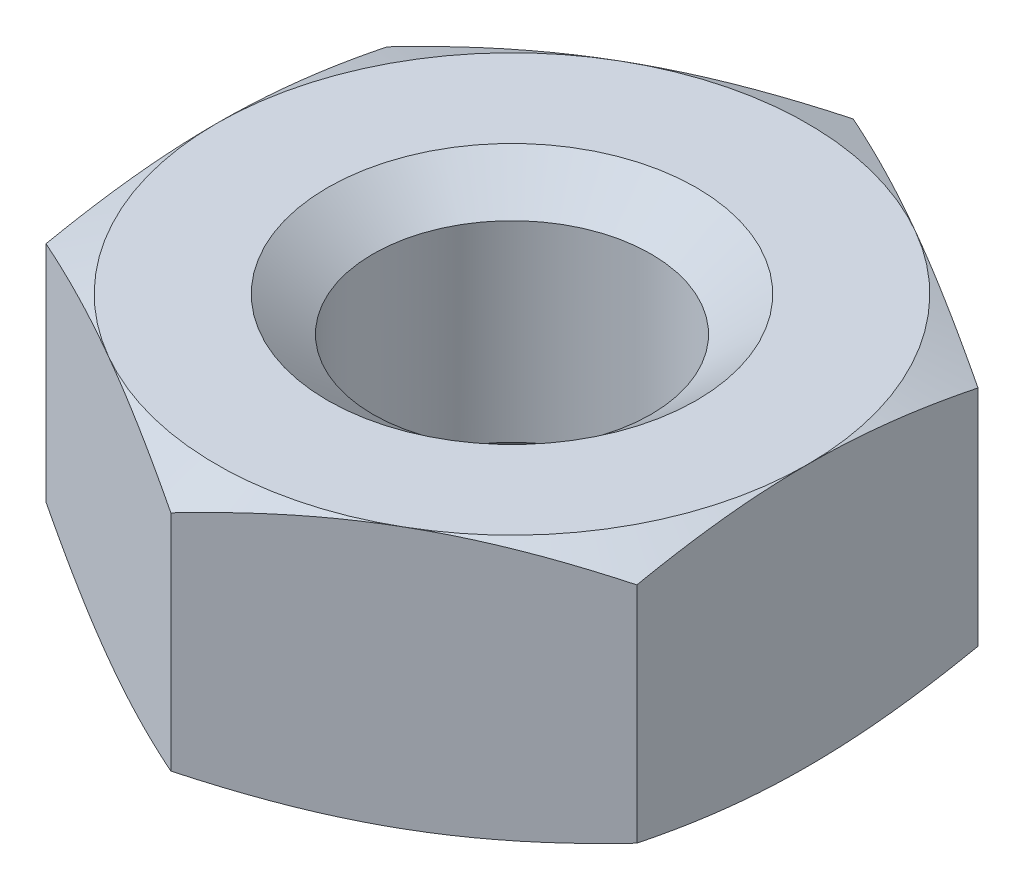
ISO-10303-21;
HEADER;
FILE_DESCRIPTION(('STEP AP214'),'2;1');
FILE_NAME('part.step','',(''),(''),'','','');
FILE_SCHEMA(('AUTOMOTIVE_DESIGN { 1 0 10303 214 1 1 1 1 }'));
ENDSEC;
DATA;
#1=APPLICATION_CONTEXT('core data for automotive mechanical design processes');
#2=APPLICATION_PROTOCOL_DEFINITION('international standard','automotive_design',2000,#1);
#3=PRODUCT_CONTEXT('',#1,'mechanical');
#4=PRODUCT('Part','Part','',(#3));
#5=PRODUCT_RELATED_PRODUCT_CATEGORY('part','',(#4));
#6=PRODUCT_DEFINITION_FORMATION('','',#4);
#7=PRODUCT_DEFINITION_CONTEXT('part definition',#1,'design');
#8=PRODUCT_DEFINITION('design','',#6,#7);
#9=PRODUCT_DEFINITION_SHAPE('','',#8);
#10=(LENGTH_UNIT() NAMED_UNIT(*) SI_UNIT(.MILLI.,.METRE.));
#11=(NAMED_UNIT(*) PLANE_ANGLE_UNIT() SI_UNIT($,.RADIAN.));
#12=(NAMED_UNIT(*) SI_UNIT($,.STERADIAN.) SOLID_ANGLE_UNIT());
#13=UNCERTAINTY_MEASURE_WITH_UNIT(LENGTH_MEASURE(1.E-05),#10,'distance_accuracy_value','');
#14=(GEOMETRIC_REPRESENTATION_CONTEXT(3) GLOBAL_UNCERTAINTY_ASSIGNED_CONTEXT((#13)) GLOBAL_UNIT_ASSIGNED_CONTEXT((#10,
#11,#12)) REPRESENTATION_CONTEXT('',''));
#15=CARTESIAN_POINT('',(0.,0.,0.));
#16=DIRECTION('',(0.,0.,1.));
#17=DIRECTION('',(1.,0.,0.));
#18=AXIS2_PLACEMENT_3D('',#15,#16,#17);
#19=CARTESIAN_POINT('',(0.,-1.52500000000001,0.));
#20=DIRECTION('',(0.,1.,0.));
#21=DIRECTION('',(0.,0.,1.));
#22=AXIS2_PLACEMENT_3D('',#19,#20,#21);
#23=CONICAL_SURFACE('',#22,3.44499999999997,1.17809724509618);
#24=CARTESIAN_POINT('',(3.44499999999999,-1.52500000000001,0.));
#25=CARTESIAN_POINT('',(3.44499999999999,-1.52500653519659,-0.0836770238553707));
#26=CARTESIAN_POINT('',(3.44499999999999,-1.523736539951,-0.167348336923047));
#27=CARTESIAN_POINT('',(3.44499999999999,-1.51869977778039,-0.334608821328024));
#28=CARTESIAN_POINT('',(3.44499999999999,-1.51493322636125,-0.418197999131677));
#29=CARTESIAN_POINT('',(3.44499999999999,-1.50000011813595,-0.668300761406539));
#30=CARTESIAN_POINT('',(3.44499999999999,-1.48519949166168,-0.834608265477263));
#31=CARTESIAN_POINT('',(3.44499999999999,-1.44691557663054,-1.16608574327092));
#32=CARTESIAN_POINT('',(3.44499999999999,-1.42343721863474,-1.33125630880567));
#33=CARTESIAN_POINT('',(3.44499999999999,-1.36907122689802,-1.66083827114248));
#34=CARTESIAN_POINT('',(3.44499999999999,-1.33816390417375,-1.82524644688072));
#35=CARTESIAN_POINT('',(3.44499999999999,-1.30424763449981,-1.98897167735825));
#36=B_SPLINE_CURVE_WITH_KNOTS('',3,(#24,#25,#26,#27,#28,#29,#30,#31,#32,#33,#34,#35),
.UNSPECIFIED.,.F.,.F.,(4,2,2,2,2,4),(0.,0.251010681069905,0.501999697400777,1.00260384828627,
1.50292399932506,2.00458506025341),.UNSPECIFIED.);
#37=CARTESIAN_POINT('',(3.44499999999999,-1.525,0.));
#38=VERTEX_POINT('',#37);
#39=CARTESIAN_POINT('',(3.44499999999999,-1.30424763449981,-1.98897167735825));
#40=VERTEX_POINT('',#39);
#41=EDGE_CURVE('E250',#38,#40,#36,.T.);
#42=ORIENTED_EDGE('',*,*,#41,.F.);
#43=CARTESIAN_POINT('',(0.,-1.525,0.));
#44=DIRECTION('',(0.,1.,0.));
#45=DIRECTION('',(0.,0.,1.));
#46=AXIS2_PLACEMENT_3D('',#43,#44,#45);
#47=CIRCLE('',#46,3.44499999999998);
#48=CARTESIAN_POINT('',(1.7225,-1.525,-2.98345751603738));
#49=VERTEX_POINT('',#48);
#50=EDGE_CURVE('E112',#49,#38,#47,.F.);
#51=ORIENTED_EDGE('',*,*,#50,.F.);
#52=CARTESIAN_POINT('',(3.44499999999998,-1.30424763449981,-1.98897167735824));
#53=CARTESIAN_POINT('',(3.30320979116598,-1.33816390417375,-2.07083429259701));
#54=CARTESIAN_POINT('',(3.16082813438681,-1.36907122689802,-2.15303838046613));
#55=CARTESIAN_POINT('',(2.875401782374,-1.42343721863474,-2.31782936163454));
#56=CARTESIAN_POINT('',(2.73235987666347,-1.44691557663055,-2.40041464440191));
#57=CARTESIAN_POINT('',(2.44529196011177,-1.48519949166168,-2.56615338329874));
#58=CARTESIAN_POINT('',(2.30126543674653,-1.50000011813595,-2.6493071353341));
#59=CARTESIAN_POINT('',(2.08467009105984,-1.51493322636125,-2.77435851647153));
#60=CARTESIAN_POINT('',(2.01227973960043,-1.51869977778039,-2.81615310537336));
#61=CARTESIAN_POINT('',(1.86742791105642,-1.52373653995101,-2.89978334757585));
#62=CARTESIAN_POINT('',(1.79496642837181,-1.52500653519659,-2.94161900410969));
#63=CARTESIAN_POINT('',(1.72249999999999,-1.52500000000001,-2.98345751603737));
#64=B_SPLINE_CURVE_WITH_KNOTS('',3,(#52,#53,#54,#55,#56,#57,#58,#59,#60,#61,#62,#63),
.UNSPECIFIED.,.F.,.F.,(4,2,2,2,2,4),(0.,0.501661060928354,1.00198121196715,1.50258536285264,
1.75357437918352,2.00458506025342),.UNSPECIFIED.);
#65=EDGE_CURVE('E249',#40,#49,#64,.T.);
#66=ORIENTED_EDGE('',*,*,#65,.F.);
#67=EDGE_LOOP('',(#42,#51,#66));
#68=FACE_BOUND('',#67,.T.);
#69=ADVANCED_FACE('F15',(#68),#23,.T.);
#70=CARTESIAN_POINT('',(0.,-1.11908402335913,0.));
#71=DIRECTION('',(0.,-1.,0.));
#72=DIRECTION('',(0.,0.,-1.));
#73=AXIS2_PLACEMENT_3D('',#70,#71,#72);
#74=CONICAL_SURFACE('',#73,1.621,0.916297857297024);
#75=CARTESIAN_POINT('',(0.,-1.11908402335913,0.));
#76=DIRECTION('',(0.,-1.,0.));
#77=DIRECTION('',(0.,0.,-1.));
#78=AXIS2_PLACEMENT_3D('',#75,#76,#77);
#79=CIRCLE('',#78,1.621);
#80=CARTESIAN_POINT('',(0.,-1.11908402335913,-1.621));
#81=VERTEX_POINT('',#80);
#82=EDGE_CURVE('E244',#81,#81,#79,.T.);
#83=ORIENTED_EDGE('',*,*,#82,.F.);
#84=EDGE_LOOP('',(#83));
#85=FACE_BOUND('',#84,.T.);
#86=CARTESIAN_POINT('',(0.,-1.525,0.));
#87=DIRECTION('',(0.,-1.,0.));
#88=DIRECTION('',(0.,0.,-1.));
#89=AXIS2_PLACEMENT_3D('',#86,#87,#88);
#90=CIRCLE('',#89,2.15);
#91=CARTESIAN_POINT('',(0.,-1.525,-2.15));
#92=VERTEX_POINT('',#91);
#93=EDGE_CURVE('E355',#92,#92,#90,.F.);
#94=ORIENTED_EDGE('',*,*,#93,.F.);
#95=EDGE_LOOP('',(#94));
#96=FACE_BOUND('',#95,.T.);
#97=ADVANCED_FACE('F525',(#85,#96),#74,.F.);
#98=CARTESIAN_POINT('',(0.,-1.52500000000001,0.));
#99=DIRECTION('',(0.,1.,0.));
#100=DIRECTION('',(0.,0.,1.));
#101=AXIS2_PLACEMENT_3D('',#98,#99,#100);
#102=CONICAL_SURFACE('',#101,3.44499999999995,1.17809724509617);
#103=CARTESIAN_POINT('',(0.,-1.525,0.));
#104=DIRECTION('',(0.,1.,0.));
#105=DIRECTION('',(0.,0.,1.));
#106=AXIS2_PLACEMENT_3D('',#103,#104,#105);
#107=CIRCLE('',#106,3.44499999999998);
#108=CARTESIAN_POINT('',(-1.72249999999999,-1.525,-2.9834575160374));
#109=VERTEX_POINT('',#108);
#110=EDGE_CURVE('E20',#109,#49,#107,.F.);
#111=ORIENTED_EDGE('',*,*,#110,.F.);
#112=CARTESIAN_POINT('',(0.,-1.3042476344998,-3.97794335471651));
#113=CARTESIAN_POINT('',(-0.141790208834029,-1.33816390417374,-3.89608073947775));
#114=CARTESIAN_POINT('',(-0.284171865613201,-1.36907122689801,-3.81387665160863));
#115=CARTESIAN_POINT('',(-0.569598217625999,-1.42343721863473,-3.64908567044023));
#116=CARTESIAN_POINT('',(-0.712640123336535,-1.44691557663054,-3.56650038767285));
#117=CARTESIAN_POINT('',(-0.99970803988823,-1.48519949166167,-3.40076164877602));
#118=CARTESIAN_POINT('',(-1.14373456325346,-1.50000011813594,-3.31760789674066));
#119=CARTESIAN_POINT('',(-1.36032990894015,-1.51493322636124,-3.19255651560323));
#120=CARTESIAN_POINT('',(-1.43272026039957,-1.51869977778038,-3.15076192670141));
#121=CARTESIAN_POINT('',(-1.57757208894356,-1.523736539951,-3.06713168449892));
#122=CARTESIAN_POINT('',(-1.65003357162817,-1.52500653519658,-3.02529602796508));
#123=CARTESIAN_POINT('',(-1.7225,-1.525,-2.9834575160374));
#124=B_SPLINE_CURVE_WITH_KNOTS('',3,(#112,#113,#114,#115,#116,#117,#118,#119,#120,#121,#122,
#123),.UNSPECIFIED.,.F.,.F.,(4,2,2,2,2,4),(0.,0.501661060928347,1.00198121196714,
1.50258536285262,1.75357437918349,2.0045850602534),.UNSPECIFIED.);
#125=CARTESIAN_POINT('',(0.,-1.3042476344998,-3.97794335471651));
#126=VERTEX_POINT('',#125);
#127=EDGE_CURVE('E107',#126,#109,#124,.T.);
#128=ORIENTED_EDGE('',*,*,#127,.F.);
#129=CARTESIAN_POINT('',(1.72249999999999,-1.52500000000001,-2.98345751603737));
#130=CARTESIAN_POINT('',(1.65003357162816,-1.52500653519659,-3.02529602796506));
#131=CARTESIAN_POINT('',(1.57757208894355,-1.52373653995101,-3.0671316844989));
#132=CARTESIAN_POINT('',(1.43272026039955,-1.51869977778039,-3.15076192670139));
#133=CARTESIAN_POINT('',(1.36032990894013,-1.51493322636125,-3.19255651560321));
#134=CARTESIAN_POINT('',(1.14373456325343,-1.50000011813595,-3.31760789674065));
#135=CARTESIAN_POINT('',(0.999708039888201,-1.48519949166168,-3.40076164877601));
#136=CARTESIAN_POINT('',(0.712640123336499,-1.44691557663054,-3.56650038767284));
#137=CARTESIAN_POINT('',(0.569598217625959,-1.42343721863474,-3.64908567044022));
#138=CARTESIAN_POINT('',(0.284171865613155,-1.36907122689801,-3.81387665160862));
#139=CARTESIAN_POINT('',(0.14179020883398,-1.33816390417374,-3.89608073947775));
#140=CARTESIAN_POINT('',(0.,-1.3042476344998,-3.97794335471651));
#141=B_SPLINE_CURVE_WITH_KNOTS('',3,(#129,#130,#131,#132,#133,#134,#135,#136,#137,#138,#139,
#140),.UNSPECIFIED.,.F.,.F.,(4,2,2,2,2,4),(0.,0.251010681069908,0.501999697400784,
1.00260384828628,1.50292399932508,2.00458506025344),.UNSPECIFIED.);
#142=EDGE_CURVE('E109',#49,#126,#141,.T.);
#143=ORIENTED_EDGE('',*,*,#142,.F.);
#144=EDGE_LOOP('',(#111,#128,#143));
#145=FACE_BOUND('',#144,.T.);
#146=ADVANCED_FACE('F106',(#145),#102,.T.);
#147=CARTESIAN_POINT('',(-3.455,-1.525,3.98794335471652));
#148=DIRECTION('',(0.,-1.,0.));
#149=DIRECTION('',(0.,0.,-1.));
#150=AXIS2_PLACEMENT_3D('',#147,#148,#149);
#151=PLANE('',#150);
#152=ORIENTED_EDGE('',*,*,#93,.T.);
#153=EDGE_LOOP('',(#152));
#154=FACE_BOUND('',#153,.T.);
#155=CARTESIAN_POINT('',(0.,-1.52500000000001,0.));
#156=DIRECTION('',(0.,1.,0.));
#157=DIRECTION('',(0.,0.,1.));
#158=AXIS2_PLACEMENT_3D('',#155,#156,#157);
#159=CIRCLE('',#158,3.44499999999998);
#160=CARTESIAN_POINT('',(1.7225,-1.525,2.98345751603739));
#161=VERTEX_POINT('',#160);
#162=EDGE_CURVE('E346',#161,#38,#159,.T.);
#163=ORIENTED_EDGE('',*,*,#162,.F.);
#164=CARTESIAN_POINT('',(0.,-1.525,0.));
#165=DIRECTION('',(0.,1.,0.));
#166=DIRECTION('',(0.,0.,1.));
#167=AXIS2_PLACEMENT_3D('',#164,#165,#166);
#168=CIRCLE('',#167,3.44499999999999);
#169=CARTESIAN_POINT('',(-1.72249999999999,-1.525,2.98345751603741));
#170=VERTEX_POINT('',#169);
#171=EDGE_CURVE('E375',#170,#161,#168,.T.);
#172=ORIENTED_EDGE('',*,*,#171,.F.);
#173=CARTESIAN_POINT('',(0.,-1.525,0.));
#174=DIRECTION('',(0.,1.,0.));
#175=DIRECTION('',(0.,0.,1.));
#176=AXIS2_PLACEMENT_3D('',#173,#174,#175);
#177=CIRCLE('',#176,3.44500000000002);
#178=CARTESIAN_POINT('',(-3.44500000000001,-1.52499999999999,0.));
#179=VERTEX_POINT('',#178);
#180=EDGE_CURVE('E126',#179,#170,#177,.T.);
#181=ORIENTED_EDGE('',*,*,#180,.F.);
#182=CARTESIAN_POINT('',(0.,-1.525,0.));
#183=DIRECTION('',(0.,1.,0.));
#184=DIRECTION('',(0.,0.,1.));
#185=AXIS2_PLACEMENT_3D('',#182,#183,#184);
#186=CIRCLE('',#185,3.44500000000002);
#187=EDGE_CURVE('E123',#109,#179,#186,.T.);
#188=ORIENTED_EDGE('',*,*,#187,.F.);
#189=ORIENTED_EDGE('',*,*,#110,.T.);
#190=ORIENTED_EDGE('',*,*,#50,.T.);
#191=EDGE_LOOP('',(#163,#172,#181,#188,#189,#190));
#192=FACE_BOUND('',#191,.T.);
#193=ADVANCED_FACE('F124',(#154,#192),#151,.T.);
#194=CARTESIAN_POINT('',(0.,-1.52500000000001,0.));
#195=DIRECTION('',(0.,1.,0.));
#196=DIRECTION('',(0.,0.,1.));
#197=AXIS2_PLACEMENT_3D('',#194,#195,#196);
#198=CONICAL_SURFACE('',#197,3.44499999999998,1.17809724509616);
#199=CARTESIAN_POINT('',(1.7225,-1.525,2.9834575160374));
#200=CARTESIAN_POINT('',(1.79496642837183,-1.52500653519658,2.94161900410971));
#201=CARTESIAN_POINT('',(1.86742791105644,-1.523736539951,2.89978334757587));
#202=CARTESIAN_POINT('',(2.01227973960044,-1.51869977778038,2.81615310537339));
#203=CARTESIAN_POINT('',(2.08467009105986,-1.51493322636124,2.77435851647156));
#204=CARTESIAN_POINT('',(2.30126543674655,-1.50000011813594,2.64930713533413));
#205=CARTESIAN_POINT('',(2.44529196011178,-1.48519949166167,2.56615338329877));
#206=CARTESIAN_POINT('',(2.73235987666347,-1.44691557663053,2.40041464440194));
#207=CARTESIAN_POINT('',(2.87540178237401,-1.42343721863473,2.31782936163457));
#208=CARTESIAN_POINT('',(3.16082813438681,-1.36907122689801,2.15303838046617));
#209=CARTESIAN_POINT('',(3.30320979116598,-1.33816390417373,2.07083429259705));
#210=CARTESIAN_POINT('',(3.44499999999999,-1.3042476344998,1.98897167735828));
#211=B_SPLINE_CURVE_WITH_KNOTS('',3,(#199,#200,#201,#202,#203,#204,#205,#206,#207,#208,#209,
#210),.UNSPECIFIED.,.F.,.F.,(4,2,2,2,2,4),(0.,0.251010681069903,0.501999697400774,
1.00260384828626,1.50292399932505,2.0045850602534),.UNSPECIFIED.);
#212=CARTESIAN_POINT('',(3.44499999999999,-1.3042476344998,1.98897167735828));
#213=VERTEX_POINT('',#212);
#214=EDGE_CURVE('E242',#161,#213,#211,.T.);
#215=ORIENTED_EDGE('',*,*,#214,.F.);
#216=ORIENTED_EDGE('',*,*,#162,.T.);
#217=CARTESIAN_POINT('',(3.44499999999999,-1.3042476344998,1.98897167735828));
#218=CARTESIAN_POINT('',(3.44499999999999,-1.33816390417374,1.82524644688074));
#219=CARTESIAN_POINT('',(3.44499999999999,-1.36907122689801,1.6608382711425));
#220=CARTESIAN_POINT('',(3.44499999999999,-1.42343721863473,1.33125630880569));
#221=CARTESIAN_POINT('',(3.44499999999999,-1.44691557663054,1.16608574327093));
#222=CARTESIAN_POINT('',(3.44499999999999,-1.48519949166168,0.834608265477274));
#223=CARTESIAN_POINT('',(3.44499999999999,-1.50000011813595,0.668300761406547));
#224=CARTESIAN_POINT('',(3.44499999999999,-1.51493322636125,0.418197999131681));
#225=CARTESIAN_POINT('',(3.44499999999999,-1.51869977778039,0.334608821328027));
#226=CARTESIAN_POINT('',(3.44499999999999,-1.52373653995101,0.167348336923048));
#227=CARTESIAN_POINT('',(3.44499999999999,-1.52500653519659,0.0836770238553703));
#228=CARTESIAN_POINT('',(3.44499999999999,-1.52500000000001,0.));
#229=B_SPLINE_CURVE_WITH_KNOTS('',3,(#217,#218,#219,#220,#221,#222,#223,#224,#225,#226,#227,
#228),.UNSPECIFIED.,.F.,.F.,(4,2,2,2,2,4),(0.,0.501661060928359,1.00198121196716,
1.50258536285266,1.75357437918354,2.00458506025344),.UNSPECIFIED.);
#230=EDGE_CURVE('E338',#213,#38,#229,.T.);
#231=ORIENTED_EDGE('',*,*,#230,.F.);
#232=EDGE_LOOP('',(#215,#216,#231));
#233=FACE_BOUND('',#232,.T.);
#234=ADVANCED_FACE('F329',(#233),#198,.T.);
#235=CARTESIAN_POINT('',(3.44499999999999,-1.53500000000001,1.99897167735828));
#236=DIRECTION('',(1.,0.,0.));
#237=DIRECTION('',(0.,0.,-1.));
#238=AXIS2_PLACEMENT_3D('',#235,#236,#237);
#239=PLANE('',#238);
#240=ORIENTED_EDGE('',*,*,#41,.T.);
#241=DIRECTION('',(0.,-1.,0.));
#242=VECTOR('',#241,1.);
#243=CARTESIAN_POINT('',(3.44499999999998,0.,-1.98897167735824));
#244=LINE('',#243,#242);
#245=CARTESIAN_POINT('',(3.44499999999998,1.30424763449981,-1.98897167735824));
#246=VERTEX_POINT('',#245);
#247=EDGE_CURVE('E247',#246,#40,#244,.T.);
#248=ORIENTED_EDGE('',*,*,#247,.F.);
#249=CARTESIAN_POINT('',(3.44499999999999,1.525,0.));
#250=CARTESIAN_POINT('',(3.44499999999999,1.52500653519659,-0.0836770238553706));
#251=CARTESIAN_POINT('',(3.44499999999999,1.523736539951,-0.167348336923047));
#252=CARTESIAN_POINT('',(3.44499999999999,1.51869977778038,-0.334608821328024));
#253=CARTESIAN_POINT('',(3.44499999999999,1.51493322636125,-0.418197999131677));
#254=CARTESIAN_POINT('',(3.44499999999999,1.50000011813594,-0.668300761406538));
#255=CARTESIAN_POINT('',(3.44499999999999,1.48519949166168,-0.834608265477262));
#256=CARTESIAN_POINT('',(3.44499999999999,1.44691557663054,-1.16608574327092));
#257=CARTESIAN_POINT('',(3.44499999999999,1.42343721863474,-1.33125630880567));
#258=CARTESIAN_POINT('',(3.44499999999999,1.36907122689801,-1.66083827114248));
#259=CARTESIAN_POINT('',(3.44499999999999,1.33816390417374,-1.82524644688072));
#260=CARTESIAN_POINT('',(3.44499999999999,1.30424763449981,-1.98897167735825));
#261=B_SPLINE_CURVE_WITH_KNOTS('',3,(#249,#250,#251,#252,#253,#254,#255,#256,#257,#258,#259,
#260),.UNSPECIFIED.,.F.,.F.,(4,2,2,2,2,4),(0.,0.251010681069904,0.501999697400776,
1.00260384828627,1.50292399932506,2.00458506025341),.UNSPECIFIED.);
#262=CARTESIAN_POINT('',(3.44499999999999,1.525,0.));
#263=VERTEX_POINT('',#262);
#264=EDGE_CURVE('E418',#263,#246,#261,.T.);
#265=ORIENTED_EDGE('',*,*,#264,.F.);
#266=CARTESIAN_POINT('',(3.44499999999999,1.3042476344998,1.98897167735828));
#267=CARTESIAN_POINT('',(3.44499999999999,1.33816390417373,1.82524644688074));
#268=CARTESIAN_POINT('',(3.44499999999999,1.36907122689801,1.6608382711425));
#269=CARTESIAN_POINT('',(3.44499999999999,1.42343721863473,1.33125630880569));
#270=CARTESIAN_POINT('',(3.44499999999999,1.44691557663054,1.16608574327093));
#271=CARTESIAN_POINT('',(3.44499999999999,1.48519949166168,0.834608265477274));
#272=CARTESIAN_POINT('',(3.44499999999999,1.50000011813595,0.668300761406548));
#273=CARTESIAN_POINT('',(3.44499999999999,1.51493322636125,0.418197999131682));
#274=CARTESIAN_POINT('',(3.44499999999999,1.51869977778039,0.334608821328027));
#275=CARTESIAN_POINT('',(3.44499999999999,1.52373653995101,0.167348336923048));
#276=CARTESIAN_POINT('',(3.44499999999999,1.52500653519659,0.0836770238553703));
#277=CARTESIAN_POINT('',(3.44499999999999,1.52500000000001,0.));
#278=B_SPLINE_CURVE_WITH_KNOTS('',3,(#266,#267,#268,#269,#270,#271,#272,#273,#274,#275,#276,
#277),.UNSPECIFIED.,.F.,.F.,(4,2,2,2,2,4),(0.,0.50166106092836,1.00198121196716,
1.50258536285266,1.75357437918354,2.00458506025345),.UNSPECIFIED.);
#279=CARTESIAN_POINT('',(3.44499999999999,1.3042476344998,1.98897167735828));
#280=VERTEX_POINT('',#279);
#281=EDGE_CURVE('E309',#280,#263,#278,.T.);
#282=ORIENTED_EDGE('',*,*,#281,.F.);
#283=DIRECTION('',(0.,1.,0.));
#284=VECTOR('',#283,1.);
#285=CARTESIAN_POINT('',(3.44499999999999,0.,1.98897167735828));
#286=LINE('',#285,#284);
#287=EDGE_CURVE('E238',#213,#280,#286,.T.);
#288=ORIENTED_EDGE('',*,*,#287,.F.);
#289=ORIENTED_EDGE('',*,*,#230,.T.);
#290=EDGE_LOOP('',(#240,#248,#265,#282,#288,#289));
#291=FACE_BOUND('',#290,.T.);
#292=ADVANCED_FACE('F333',(#291),#239,.T.);
#293=CARTESIAN_POINT('',(3.45366025403781,-1.53500000000001,-1.98397167735825));
#294=DIRECTION('',(0.5,0.,-0.866025403784438));
#295=DIRECTION('',(-0.866025403784438,0.,-0.5));
#296=AXIS2_PLACEMENT_3D('',#293,#294,#295);
#297=PLANE('',#296);
#298=ORIENTED_EDGE('',*,*,#142,.T.);
#299=DIRECTION('',(0.,-1.,0.));
#300=VECTOR('',#299,1.);
#301=CARTESIAN_POINT('',(0.,0.,-3.97794335471651));
#302=LINE('',#301,#300);
#303=CARTESIAN_POINT('',(0.,1.3042476344998,-3.97794335471651));
#304=VERTEX_POINT('',#303);
#305=EDGE_CURVE('E120',#304,#126,#302,.T.);
#306=ORIENTED_EDGE('',*,*,#305,.F.);
#307=CARTESIAN_POINT('',(1.72249999999999,1.52500000000001,-2.98345751603737));
#308=CARTESIAN_POINT('',(1.65003357162816,1.52500653519659,-3.02529602796506));
#309=CARTESIAN_POINT('',(1.57757208894355,1.52373653995101,-3.0671316844989));
#310=CARTESIAN_POINT('',(1.43272026039955,1.51869977778039,-3.15076192670139));
#311=CARTESIAN_POINT('',(1.36032990894013,1.51493322636125,-3.19255651560321));
#312=CARTESIAN_POINT('',(1.14373456325343,1.50000011813595,-3.31760789674065));
#313=CARTESIAN_POINT('',(0.999708039888201,1.48519949166168,-3.40076164877601));
#314=CARTESIAN_POINT('',(0.712640123336499,1.44691557663054,-3.56650038767284));
#315=CARTESIAN_POINT('',(0.569598217625959,1.42343721863474,-3.64908567044022));
#316=CARTESIAN_POINT('',(0.284171865613155,1.36907122689801,-3.81387665160862));
#317=CARTESIAN_POINT('',(0.14179020883398,1.33816390417374,-3.89608073947775));
#318=CARTESIAN_POINT('',(0.,1.3042476344998,-3.97794335471651));
#319=B_SPLINE_CURVE_WITH_KNOTS('',3,(#307,#308,#309,#310,#311,#312,#313,#314,#315,#316,#317,
#318),.UNSPECIFIED.,.F.,.F.,(4,2,2,2,2,4),(0.,0.251010681069908,0.501999697400784,
1.00260384828628,1.50292399932508,2.00458506025344),.UNSPECIFIED.);
#320=CARTESIAN_POINT('',(1.72249999999999,1.525,-2.98345751603739));
#321=VERTEX_POINT('',#320);
#322=EDGE_CURVE('E176',#321,#304,#319,.T.);
#323=ORIENTED_EDGE('',*,*,#322,.F.);
#324=CARTESIAN_POINT('',(3.44499999999998,1.30424763449981,-1.98897167735824));
#325=CARTESIAN_POINT('',(3.30320979116598,1.33816390417374,-2.07083429259701));
#326=CARTESIAN_POINT('',(3.16082813438681,1.36907122689802,-2.15303838046613));
#327=CARTESIAN_POINT('',(2.875401782374,1.42343721863474,-2.31782936163454));
#328=CARTESIAN_POINT('',(2.73235987666347,1.44691557663054,-2.40041464440191));
#329=CARTESIAN_POINT('',(2.44529196011177,1.48519949166168,-2.56615338329874));
#330=CARTESIAN_POINT('',(2.30126543674653,1.50000011813595,-2.6493071353341));
#331=CARTESIAN_POINT('',(2.08467009105984,1.51493322636125,-2.77435851647153));
#332=CARTESIAN_POINT('',(2.01227973960043,1.51869977778039,-2.81615310537336));
#333=CARTESIAN_POINT('',(1.86742791105642,1.52373653995101,-2.89978334757585));
#334=CARTESIAN_POINT('',(1.79496642837181,1.52500653519659,-2.94161900410969));
#335=CARTESIAN_POINT('',(1.72249999999999,1.52500000000001,-2.98345751603737));
#336=B_SPLINE_CURVE_WITH_KNOTS('',3,(#324,#325,#326,#327,#328,#329,#330,#331,#332,#333,#334,
#335),.UNSPECIFIED.,.F.,.F.,(4,2,2,2,2,4),(0.,0.501661060928354,1.00198121196715,
1.50258536285264,1.75357437918352,2.00458506025342),.UNSPECIFIED.);
#337=EDGE_CURVE('E420',#246,#321,#336,.T.);
#338=ORIENTED_EDGE('',*,*,#337,.F.);
#339=ORIENTED_EDGE('',*,*,#247,.T.);
#340=ORIENTED_EDGE('',*,*,#65,.T.);
#341=EDGE_LOOP('',(#298,#306,#323,#338,#339,#340));
#342=FACE_BOUND('',#341,.T.);
#343=ADVANCED_FACE('F488',(#342),#297,.T.);
#344=CARTESIAN_POINT('',(0.,-1.11908402335913,0.));
#345=DIRECTION('',(0.,1.,0.));
#346=DIRECTION('',(0.,0.,1.));
#347=AXIS2_PLACEMENT_3D('',#344,#345,#346);
#348=CYLINDRICAL_SURFACE('',#347,1.621);
#349=ORIENTED_EDGE('',*,*,#82,.T.);
#350=EDGE_LOOP('',(#349));
#351=FACE_BOUND('',#350,.T.);
#352=CARTESIAN_POINT('',(0.,1.11908402335913,0.));
#353=DIRECTION('',(0.,-1.,0.));
#354=DIRECTION('',(0.,0.,-1.));
#355=AXIS2_PLACEMENT_3D('',#352,#353,#354);
#356=CIRCLE('',#355,1.621);
#357=CARTESIAN_POINT('',(0.,1.11908402335913,-1.621));
#358=VERTEX_POINT('',#357);
#359=EDGE_CURVE('E175',#358,#358,#356,.T.);
#360=ORIENTED_EDGE('',*,*,#359,.F.);
#361=EDGE_LOOP('',(#360));
#362=FACE_BOUND('',#361,.T.);
#363=ADVANCED_FACE('F153',(#351,#362),#348,.F.);
#364=CARTESIAN_POINT('',(0.00866025403781822,-1.535,-3.98294335471651));
#365=DIRECTION('',(-0.500000000000001,0.,-0.866025403784438));
#366=DIRECTION('',(-0.866025403784438,0.,0.500000000000001));
#367=AXIS2_PLACEMENT_3D('',#364,#365,#366);
#368=PLANE('',#367);
#369=DIRECTION('',(0.,-1.,0.));
#370=VECTOR('',#369,1.);
#371=CARTESIAN_POINT('',(-3.44500000000004,0.,-1.98897167735825));
#372=LINE('',#371,#370);
#373=CARTESIAN_POINT('',(-3.44500000000004,1.30424763449979,-1.98897167735825));
#374=VERTEX_POINT('',#373);
#375=CARTESIAN_POINT('',(-3.44500000000004,-1.3042476344998,-1.98897167735825));
#376=VERTEX_POINT('',#375);
#377=EDGE_CURVE('E229',#374,#376,#372,.T.);
#378=ORIENTED_EDGE('',*,*,#377,.F.);
#379=CARTESIAN_POINT('',(-1.7225,1.52499999999999,-2.98345751603739));
#380=CARTESIAN_POINT('',(-1.79496642837183,1.52500653519657,-2.94161900410971));
#381=CARTESIAN_POINT('',(-1.86742791105644,1.52373653995099,-2.89978334757587));
#382=CARTESIAN_POINT('',(-2.01227973960044,1.51869977778037,-2.81615310537338));
#383=CARTESIAN_POINT('',(-2.08467009105986,1.51493322636123,-2.77435851647155));
#384=CARTESIAN_POINT('',(-2.30126543674656,1.50000011813593,-2.64930713533412));
#385=CARTESIAN_POINT('',(-2.44529196011179,1.48519949166166,-2.56615338329875));
#386=CARTESIAN_POINT('',(-2.7323598766635,1.44691557663053,-2.40041464440192));
#387=CARTESIAN_POINT('',(-2.87540178237404,1.42343721863472,-2.31782936163454));
#388=CARTESIAN_POINT('',(-3.16082813438685,1.369071226898,-2.15303838046613));
#389=CARTESIAN_POINT('',(-3.30320979116603,1.33816390417373,-2.07083429259701));
#390=CARTESIAN_POINT('',(-3.44500000000003,1.3042476344998,-1.98897167735824));
#391=B_SPLINE_CURVE_WITH_KNOTS('',3,(#379,#380,#381,#382,#383,#384,#385,#386,#387,#388,#389,
#390),.UNSPECIFIED.,.F.,.F.,(4,2,2,2,2,4),(0.,0.251010681069911,0.50199969740079,
1.0026038482863,1.5029239993251,2.00458506025347),.UNSPECIFIED.);
#392=CARTESIAN_POINT('',(-1.7225,1.52499999999999,-2.98345751603739));
#393=VERTEX_POINT('',#392);
#394=EDGE_CURVE('E168',#393,#374,#391,.T.);
#395=ORIENTED_EDGE('',*,*,#394,.F.);
#396=CARTESIAN_POINT('',(0.,1.3042476344998,-3.97794335471651));
#397=CARTESIAN_POINT('',(-0.14179020883403,1.33816390417374,-3.89608073947775));
#398=CARTESIAN_POINT('',(-0.284171865613202,1.36907122689801,-3.81387665160863));
#399=CARTESIAN_POINT('',(-0.569598217625999,1.42343721863473,-3.64908567044023));
#400=CARTESIAN_POINT('',(-0.712640123336535,1.44691557663054,-3.56650038767285));
#401=CARTESIAN_POINT('',(-0.999708039888231,1.48519949166167,-3.40076164877602));
#402=CARTESIAN_POINT('',(-1.14373456325346,1.50000011813594,-3.31760789674066));
#403=CARTESIAN_POINT('',(-1.36032990894015,1.51493322636124,-3.19255651560323));
#404=CARTESIAN_POINT('',(-1.43272026039957,1.51869977778038,-3.15076192670141));
#405=CARTESIAN_POINT('',(-1.57757208894357,1.523736539951,-3.06713168449892));
#406=CARTESIAN_POINT('',(-1.65003357162817,1.52500653519658,-3.02529602796508));
#407=CARTESIAN_POINT('',(-1.7225,1.525,-2.98345751603739));
#408=B_SPLINE_CURVE_WITH_KNOTS('',3,(#396,#397,#398,#399,#400,#401,#402,#403,#404,#405,#406,
#407),.UNSPECIFIED.,.F.,.F.,(4,2,2,2,2,4),(0.,0.501661060928347,1.00198121196714,
1.50258536285262,1.75357437918349,2.0045850602534),.UNSPECIFIED.);
#409=EDGE_CURVE('E158',#304,#393,#408,.T.);
#410=ORIENTED_EDGE('',*,*,#409,.F.);
#411=ORIENTED_EDGE('',*,*,#305,.T.);
#412=ORIENTED_EDGE('',*,*,#127,.T.);
#413=CARTESIAN_POINT('',(-3.44500000000003,-1.3042476344998,-1.98897167735824));
#414=CARTESIAN_POINT('',(-3.30320979116603,-1.33816390417373,-2.07083429259701));
#415=CARTESIAN_POINT('',(-3.16082813438685,-1.36907122689801,-2.15303838046613));
#416=CARTESIAN_POINT('',(-2.87540178237404,-1.42343721863473,-2.31782936163454));
#417=CARTESIAN_POINT('',(-2.7323598766635,-1.44691557663054,-2.40041464440192));
#418=CARTESIAN_POINT('',(-2.44529196011179,-1.48519949166167,-2.56615338329875));
#419=CARTESIAN_POINT('',(-2.30126543674656,-1.50000011813594,-2.64930713533412));
#420=CARTESIAN_POINT('',(-2.08467009105986,-1.51493322636124,-2.77435851647155));
#421=CARTESIAN_POINT('',(-2.01227973960044,-1.51869977778038,-2.81615310537338));
#422=CARTESIAN_POINT('',(-1.86742791105644,-1.523736539951,-2.89978334757587));
#423=CARTESIAN_POINT('',(-1.79496642837183,-1.52500653519658,-2.94161900410971));
#424=CARTESIAN_POINT('',(-1.7225,-1.525,-2.98345751603739));
#425=B_SPLINE_CURVE_WITH_KNOTS('',3,(#413,#414,#415,#416,#417,#418,#419,#420,#421,#422,#423,
#424),.UNSPECIFIED.,.F.,.F.,(4,2,2,2,2,4),(0.,0.501661060928366,1.00198121196717,
1.50258536285268,1.75357437918356,2.00458506025347),.UNSPECIFIED.);
#426=EDGE_CURVE('E117',#376,#109,#425,.T.);
#427=ORIENTED_EDGE('',*,*,#426,.F.);
#428=EDGE_LOOP('',(#378,#395,#410,#411,#412,#427));
#429=FACE_BOUND('',#428,.T.);
#430=ADVANCED_FACE('F115',(#429),#368,.T.);
#431=CARTESIAN_POINT('',(0.,-1.525,0.));
#432=DIRECTION('',(0.,1.,0.));
#433=DIRECTION('',(0.,0.,1.));
#434=AXIS2_PLACEMENT_3D('',#431,#432,#433);
#435=CONICAL_SURFACE('',#434,3.44500000000002,1.17809724509619);
#436=ORIENTED_EDGE('',*,*,#187,.T.);
#437=CARTESIAN_POINT('',(-3.44500000000004,-1.3042476344998,-1.98897167735825));
#438=CARTESIAN_POINT('',(-3.44500000000004,-1.33816390417373,-1.82524644688072));
#439=CARTESIAN_POINT('',(-3.44500000000004,-1.369071226898,-1.66083827114248));
#440=CARTESIAN_POINT('',(-3.44500000000004,-1.42343721863472,-1.33125630880567));
#441=CARTESIAN_POINT('',(-3.44500000000004,-1.44691557663052,-1.16608574327092));
#442=CARTESIAN_POINT('',(-3.44500000000004,-1.48519949166166,-0.834608265477262));
#443=CARTESIAN_POINT('',(-3.44500000000004,-1.50000011813592,-0.668300761406538));
#444=CARTESIAN_POINT('',(-3.44500000000004,-1.51493322636123,-0.418197999131676));
#445=CARTESIAN_POINT('',(-3.44500000000004,-1.51869977778036,-0.334608821328023));
#446=CARTESIAN_POINT('',(-3.44500000000004,-1.52373653995098,-0.167348336923046));
#447=CARTESIAN_POINT('',(-3.44500000000004,-1.52500653519656,-0.0836770238553699));
#448=CARTESIAN_POINT('',(-3.44500000000004,-1.52499999999998,0.));
#449=B_SPLINE_CURVE_WITH_KNOTS('',3,(#437,#438,#439,#440,#441,#442,#443,#444,#445,#446,#447,
#448),.UNSPECIFIED.,.F.,.F.,(4,2,2,2,2,4),(0.,0.501661060928352,1.00198121196714,
1.50258536285264,1.75357437918351,2.00458506025341),.UNSPECIFIED.);
#450=EDGE_CURVE('E132',#376,#179,#449,.T.);
#451=ORIENTED_EDGE('',*,*,#450,.F.);
#452=ORIENTED_EDGE('',*,*,#426,.T.);
#453=EDGE_LOOP('',(#436,#451,#452));
#454=FACE_BOUND('',#453,.T.);
#455=ADVANCED_FACE('F130',(#454),#435,.T.);
#456=CARTESIAN_POINT('',(0.,-1.525,0.));
#457=DIRECTION('',(0.,1.,0.));
#458=DIRECTION('',(0.,0.,1.));
#459=AXIS2_PLACEMENT_3D('',#456,#457,#458);
#460=CONICAL_SURFACE('',#459,3.44500000000002,1.17809724509616);
#461=ORIENTED_EDGE('',*,*,#180,.T.);
#462=CARTESIAN_POINT('',(-3.44500000000003,-1.30424763449978,1.98897167735827));
#463=CARTESIAN_POINT('',(-3.30320979116603,-1.33816390417372,2.07083429259704));
#464=CARTESIAN_POINT('',(-3.16082813438685,-1.36907122689799,2.15303838046616));
#465=CARTESIAN_POINT('',(-2.87540178237404,-1.42343721863472,2.31782936163457));
#466=CARTESIAN_POINT('',(-2.7323598766635,-1.44691557663052,2.40041464440194));
#467=CARTESIAN_POINT('',(-2.4452919601118,-1.48519949166166,2.56615338329878));
#468=CARTESIAN_POINT('',(-2.30126543674657,-1.50000011813593,2.64930713533414));
#469=CARTESIAN_POINT('',(-2.08467009105987,-1.51493322636124,2.77435851647157));
#470=CARTESIAN_POINT('',(-2.01227973960045,-1.51869977778037,2.8161531053734));
#471=CARTESIAN_POINT('',(-1.86742791105645,-1.52373653995099,2.89978334757589));
#472=CARTESIAN_POINT('',(-1.79496642837184,-1.52500653519658,2.94161900410973));
#473=CARTESIAN_POINT('',(-1.72250000000001,-1.52499999999999,2.98345751603742));
#474=B_SPLINE_CURVE_WITH_KNOTS('',3,(#462,#463,#464,#465,#466,#467,#468,#469,#470,#471,#472,
#473),.UNSPECIFIED.,.F.,.F.,(4,2,2,2,2,4),(0.,0.501661060928363,1.00198121196717,
1.50258536285267,1.75357437918355,2.00458506025346),.UNSPECIFIED.);
#475=CARTESIAN_POINT('',(-3.44500000000003,-1.30424763449978,1.98897167735827));
#476=VERTEX_POINT('',#475);
#477=EDGE_CURVE('E380',#476,#170,#474,.T.);
#478=ORIENTED_EDGE('',*,*,#477,.F.);
#479=CARTESIAN_POINT('',(-3.44500000000004,-1.52499999999998,0.));
#480=CARTESIAN_POINT('',(-3.44500000000004,-1.52500653519657,0.0836770238553709));
#481=CARTESIAN_POINT('',(-3.44500000000004,-1.52373653995098,0.167348336923048));
#482=CARTESIAN_POINT('',(-3.44500000000004,-1.51869977778036,0.334608821328027));
#483=CARTESIAN_POINT('',(-3.44500000000004,-1.51493322636123,0.418197999131681));
#484=CARTESIAN_POINT('',(-3.44500000000004,-1.50000011813592,0.668300761406547));
#485=CARTESIAN_POINT('',(-3.44500000000004,-1.48519949166165,0.834608265477273));
#486=CARTESIAN_POINT('',(-3.44500000000004,-1.44691557663052,1.16608574327093));
#487=CARTESIAN_POINT('',(-3.44500000000004,-1.42343721863471,1.33125630880569));
#488=CARTESIAN_POINT('',(-3.44500000000004,-1.36907122689799,1.6608382711425));
#489=CARTESIAN_POINT('',(-3.44500000000004,-1.33816390417372,1.82524644688074));
#490=CARTESIAN_POINT('',(-3.44500000000004,-1.30424763449978,1.98897167735827));
#491=B_SPLINE_CURVE_WITH_KNOTS('',3,(#479,#480,#481,#482,#483,#484,#485,#486,#487,#488,#489,
#490),.UNSPECIFIED.,.F.,.F.,(4,2,2,2,2,4),(0.,0.251010681069908,0.501999697400783,
1.00260384828628,1.50292399932508,2.00458506025344),.UNSPECIFIED.);
#492=EDGE_CURVE('E219',#179,#476,#491,.T.);
#493=ORIENTED_EDGE('',*,*,#492,.F.);
#494=EDGE_LOOP('',(#461,#478,#493));
#495=FACE_BOUND('',#494,.T.);
#496=ADVANCED_FACE('F378',(#495),#460,.T.);
#497=CARTESIAN_POINT('',(0.,-1.525,0.));
#498=DIRECTION('',(0.,1.,0.));
#499=DIRECTION('',(0.,0.,1.));
#500=AXIS2_PLACEMENT_3D('',#497,#498,#499);
#501=CONICAL_SURFACE('',#500,3.44499999999999,1.17809724509616);
#502=CARTESIAN_POINT('',(-1.72250000000001,-1.52499999999999,2.98345751603742));
#503=CARTESIAN_POINT('',(-1.65003357162818,-1.52500653519657,3.0252960279651));
#504=CARTESIAN_POINT('',(-1.57757208894357,-1.52373653995099,3.06713168449894));
#505=CARTESIAN_POINT('',(-1.43272026039957,-1.51869977778037,3.15076192670143));
#506=CARTESIAN_POINT('',(-1.36032990894015,-1.51493322636124,3.19255651560325));
#507=CARTESIAN_POINT('',(-1.14373456325346,-1.50000011813593,3.31760789674068));
#508=CARTESIAN_POINT('',(-0.999708039888232,-1.48519949166166,3.40076164877605));
#509=CARTESIAN_POINT('',(-0.712640123336534,-1.44691557663053,3.56650038767287));
#510=CARTESIAN_POINT('',(-0.569598217625997,-1.42343721863472,3.64908567044025));
#511=CARTESIAN_POINT('',(-0.284171865613196,-1.369071226898,3.81387665160865));
#512=CARTESIAN_POINT('',(-0.141790208834023,-1.33816390417373,3.89608073947777));
#513=CARTESIAN_POINT('',(0.,-1.30424763449979,3.97794335471654));
#514=B_SPLINE_CURVE_WITH_KNOTS('',3,(#502,#503,#504,#505,#506,#507,#508,#509,#510,#511,#512,
#513),.UNSPECIFIED.,.F.,.F.,(4,2,2,2,2,4),(0.,0.251010681069905,0.501999697400777,
1.00260384828627,1.50292399932506,2.00458506025341),.UNSPECIFIED.);
#515=CARTESIAN_POINT('',(0.,-1.30424763449979,3.97794335471654));
#516=VERTEX_POINT('',#515);
#517=EDGE_CURVE('E286',#170,#516,#514,.T.);
#518=ORIENTED_EDGE('',*,*,#517,.F.);
#519=ORIENTED_EDGE('',*,*,#171,.T.);
#520=CARTESIAN_POINT('',(0.,-1.30424763449979,3.97794335471654));
#521=CARTESIAN_POINT('',(0.141790208833985,-1.33816390417373,3.89608073947777));
#522=CARTESIAN_POINT('',(0.284171865613161,-1.369071226898,3.81387665160865));
#523=CARTESIAN_POINT('',(0.569598217625967,-1.42343721863473,3.64908567044024));
#524=CARTESIAN_POINT('',(0.712640123336508,-1.44691557663054,3.56650038767287));
#525=CARTESIAN_POINT('',(0.999708039888212,-1.48519949166167,3.40076164877603));
#526=CARTESIAN_POINT('',(1.14373456325345,-1.50000011813594,3.31760789674067));
#527=CARTESIAN_POINT('',(1.36032990894014,-1.51493322636125,3.19255651560324));
#528=CARTESIAN_POINT('',(1.43272026039956,-1.51869977778038,3.15076192670141));
#529=CARTESIAN_POINT('',(1.57757208894357,-1.523736539951,3.06713168449892));
#530=CARTESIAN_POINT('',(1.65003357162818,-1.52500653519659,3.02529602796508));
#531=CARTESIAN_POINT('',(1.7225,-1.525,2.9834575160374));
#532=B_SPLINE_CURVE_WITH_KNOTS('',3,(#520,#521,#522,#523,#524,#525,#526,#527,#528,#529,#530,
#531),.UNSPECIFIED.,.F.,.F.,(4,2,2,2,2,4),(0.,0.501661060928362,1.00198121196717,
1.50258536285267,1.75357437918355,2.00458506025346),.UNSPECIFIED.);
#533=EDGE_CURVE('E323',#516,#161,#532,.T.);
#534=ORIENTED_EDGE('',*,*,#533,.F.);
#535=EDGE_LOOP('',(#518,#519,#534));
#536=FACE_BOUND('',#535,.T.);
#537=ADVANCED_FACE('F382',(#536),#501,.T.);
#538=CARTESIAN_POINT('',(-0.00866025403786628,-1.535,3.98294335471654));
#539=DIRECTION('',(0.499999999999998,0.,0.866025403784439));
#540=DIRECTION('',(0.866025403784439,0.,-0.499999999999998));
#541=AXIS2_PLACEMENT_3D('',#538,#539,#540);
#542=PLANE('',#541);
#543=ORIENTED_EDGE('',*,*,#214,.T.);
#544=ORIENTED_EDGE('',*,*,#287,.T.);
#545=CARTESIAN_POINT('',(1.7225,1.525,2.9834575160374));
#546=CARTESIAN_POINT('',(1.79496642837183,1.52500653519658,2.94161900410971));
#547=CARTESIAN_POINT('',(1.86742791105644,1.523736539951,2.89978334757587));
#548=CARTESIAN_POINT('',(2.01227973960044,1.51869977778038,2.81615310537339));
#549=CARTESIAN_POINT('',(2.08467009105986,1.51493322636124,2.77435851647156));
#550=CARTESIAN_POINT('',(2.30126543674655,1.50000011813594,2.64930713533413));
#551=CARTESIAN_POINT('',(2.44529196011178,1.48519949166167,2.56615338329877));
#552=CARTESIAN_POINT('',(2.73235987666347,1.44691557663053,2.40041464440194));
#553=CARTESIAN_POINT('',(2.87540178237401,1.42343721863473,2.31782936163457));
#554=CARTESIAN_POINT('',(3.16082813438681,1.36907122689801,2.15303838046617));
#555=CARTESIAN_POINT('',(3.30320979116598,1.33816390417373,2.07083429259705));
#556=CARTESIAN_POINT('',(3.44499999999998,1.3042476344998,1.98897167735828));
#557=B_SPLINE_CURVE_WITH_KNOTS('',3,(#545,#546,#547,#548,#549,#550,#551,#552,#553,#554,#555,
#556),.UNSPECIFIED.,.F.,.F.,(4,2,2,2,2,4),(0.,0.251010681069903,0.501999697400774,
1.00260384828626,1.50292399932505,2.0045850602534),.UNSPECIFIED.);
#558=CARTESIAN_POINT('',(1.7225,1.525,2.9834575160374));
#559=VERTEX_POINT('',#558);
#560=EDGE_CURVE('E412',#559,#280,#557,.T.);
#561=ORIENTED_EDGE('',*,*,#560,.F.);
#562=CARTESIAN_POINT('',(0.,1.30424763449979,3.97794335471654));
#563=CARTESIAN_POINT('',(0.141790208833985,1.33816390417373,3.89608073947777));
#564=CARTESIAN_POINT('',(0.284171865613161,1.369071226898,3.81387665160865));
#565=CARTESIAN_POINT('',(0.569598217625968,1.42343721863473,3.64908567044024));
#566=CARTESIAN_POINT('',(0.712640123336508,1.44691557663053,3.56650038767287));
#567=CARTESIAN_POINT('',(0.999708039888213,1.48519949166167,3.40076164877603));
#568=CARTESIAN_POINT('',(1.14373456325345,1.50000011813594,3.31760789674067));
#569=CARTESIAN_POINT('',(1.36032990894014,1.51493322636125,3.19255651560324));
#570=CARTESIAN_POINT('',(1.43272026039956,1.51869977778038,3.15076192670141));
#571=CARTESIAN_POINT('',(1.57757208894357,1.523736539951,3.06713168449892));
#572=CARTESIAN_POINT('',(1.65003357162818,1.52500653519659,3.02529602796508));
#573=CARTESIAN_POINT('',(1.7225,1.525,2.9834575160374));
#574=B_SPLINE_CURVE_WITH_KNOTS('',3,(#562,#563,#564,#565,#566,#567,#568,#569,#570,#571,#572,
#573),.UNSPECIFIED.,.F.,.F.,(4,2,2,2,2,4),(0.,0.501661060928362,1.00198121196716,
1.50258536285267,1.75357437918355,2.00458506025346),.UNSPECIFIED.);
#575=CARTESIAN_POINT('',(0.,1.30424763449979,3.97794335471654));
#576=VERTEX_POINT('',#575);
#577=EDGE_CURVE('E241',#576,#559,#574,.T.);
#578=ORIENTED_EDGE('',*,*,#577,.F.);
#579=DIRECTION('',(0.,1.,0.));
#580=VECTOR('',#579,1.);
#581=CARTESIAN_POINT('',(0.,0.,3.97794335471654));
#582=LINE('',#581,#580);
#583=EDGE_CURVE('E285',#516,#576,#582,.T.);
#584=ORIENTED_EDGE('',*,*,#583,.F.);
#585=ORIENTED_EDGE('',*,*,#533,.T.);
#586=EDGE_LOOP('',(#543,#544,#561,#578,#584,#585));
#587=FACE_BOUND('',#586,.T.);
#588=ADVANCED_FACE('F298',(#587),#542,.T.);
#589=CARTESIAN_POINT('',(0.,1.30424763449979,0.));
#590=DIRECTION('',(0.,-1.,0.));
#591=DIRECTION('',(0.,0.,-1.));
#592=AXIS2_PLACEMENT_3D('',#589,#590,#591);
#593=CONICAL_SURFACE('',#592,3.97794335471655,1.17809724509616);
#594=CARTESIAN_POINT('',(0.,1.525,0.));
#595=DIRECTION('',(0.,-1.,0.));
#596=DIRECTION('',(0.,0.,-1.));
#597=AXIS2_PLACEMENT_3D('',#594,#595,#596);
#598=CIRCLE('',#597,3.44500000000002);
#599=CARTESIAN_POINT('',(-1.7225,1.525,2.98345751603741));
#600=VERTEX_POINT('',#599);
#601=EDGE_CURVE('E35',#600,#559,#598,.F.);
#602=ORIENTED_EDGE('',*,*,#601,.F.);
#603=CARTESIAN_POINT('',(0.,1.30424763449979,3.97794335471654));
#604=CARTESIAN_POINT('',(-0.141790208834024,1.33816390417372,3.89608073947777));
#605=CARTESIAN_POINT('',(-0.284171865613197,1.369071226898,3.81387665160865));
#606=CARTESIAN_POINT('',(-0.569598217625997,1.42343721863472,3.64908567044025));
#607=CARTESIAN_POINT('',(-0.712640123336534,1.44691557663053,3.56650038767287));
#608=CARTESIAN_POINT('',(-0.999708039888232,1.48519949166166,3.40076164877605));
#609=CARTESIAN_POINT('',(-1.14373456325346,1.50000011813593,3.31760789674069));
#610=CARTESIAN_POINT('',(-1.36032990894015,1.51493322636124,3.19255651560325));
#611=CARTESIAN_POINT('',(-1.43272026039957,1.51869977778037,3.15076192670143));
#612=CARTESIAN_POINT('',(-1.57757208894357,1.52373653995099,3.06713168449894));
#613=CARTESIAN_POINT('',(-1.65003357162818,1.52500653519657,3.0252960279651));
#614=CARTESIAN_POINT('',(-1.72250000000001,1.52499999999999,2.98345751603742));
#615=B_SPLINE_CURVE_WITH_KNOTS('',3,(#603,#604,#605,#606,#607,#608,#609,#610,#611,#612,#613,
#614),.UNSPECIFIED.,.F.,.F.,(4,2,2,2,2,4),(0.,0.501661060928352,1.00198121196714,
1.50258536285264,1.75357437918351,2.00458506025341),.UNSPECIFIED.);
#616=EDGE_CURVE('E278',#576,#600,#615,.T.);
#617=ORIENTED_EDGE('',*,*,#616,.F.);
#618=ORIENTED_EDGE('',*,*,#577,.T.);
#619=EDGE_LOOP('',(#602,#617,#618));
#620=FACE_BOUND('',#619,.T.);
#621=ADVANCED_FACE('F292',(#620),#593,.T.);
#622=CARTESIAN_POINT('',(0.,1.3042476344998,0.));
#623=DIRECTION('',(0.,-1.,0.));
#624=DIRECTION('',(0.,0.,-1.));
#625=AXIS2_PLACEMENT_3D('',#622,#623,#624);
#626=CONICAL_SURFACE('',#625,3.9779433547165,1.17809724509616);
#627=CARTESIAN_POINT('',(0.,1.52500000000001,0.));
#628=DIRECTION('',(0.,-1.,0.));
#629=DIRECTION('',(0.,0.,-1.));
#630=AXIS2_PLACEMENT_3D('',#627,#628,#629);
#631=CIRCLE('',#630,3.44499999999998);
#632=EDGE_CURVE('E274',#559,#263,#631,.F.);
#633=ORIENTED_EDGE('',*,*,#632,.F.);
#634=ORIENTED_EDGE('',*,*,#560,.T.);
#635=ORIENTED_EDGE('',*,*,#281,.T.);
#636=EDGE_LOOP('',(#633,#634,#635));
#637=FACE_BOUND('',#636,.T.);
#638=ADVANCED_FACE('F297',(#637),#626,.T.);
#639=CARTESIAN_POINT('',(0.,1.30424763449981,0.));
#640=DIRECTION('',(0.,-1.,0.));
#641=DIRECTION('',(0.,0.,-1.));
#642=AXIS2_PLACEMENT_3D('',#639,#640,#641);
#643=CONICAL_SURFACE('',#642,3.97794335471651,1.17809724509618);
#644=CARTESIAN_POINT('',(0.,1.525,0.));
#645=DIRECTION('',(0.,-1.,0.));
#646=DIRECTION('',(0.,0.,-1.));
#647=AXIS2_PLACEMENT_3D('',#644,#645,#646);
#648=CIRCLE('',#647,3.44500000000001);
#649=EDGE_CURVE('E271',#263,#321,#648,.F.);
#650=ORIENTED_EDGE('',*,*,#649,.F.);
#651=ORIENTED_EDGE('',*,*,#264,.T.);
#652=ORIENTED_EDGE('',*,*,#337,.T.);
#653=EDGE_LOOP('',(#650,#651,#652));
#654=FACE_BOUND('',#653,.T.);
#655=ADVANCED_FACE('F417',(#654),#643,.T.);
#656=CARTESIAN_POINT('',(0.,1.3042476344998,0.));
#657=DIRECTION('',(0.,-1.,0.));
#658=DIRECTION('',(0.,0.,-1.));
#659=AXIS2_PLACEMENT_3D('',#656,#657,#658);
#660=CONICAL_SURFACE('',#659,3.97794335471649,1.17809724509617);
#661=CARTESIAN_POINT('',(0.,1.525,0.));
#662=DIRECTION('',(0.,-1.,0.));
#663=DIRECTION('',(0.,0.,-1.));
#664=AXIS2_PLACEMENT_3D('',#661,#662,#663);
#665=CIRCLE('',#664,3.44499999999999);
#666=EDGE_CURVE('E266',#321,#393,#665,.F.);
#667=ORIENTED_EDGE('',*,*,#666,.F.);
#668=ORIENTED_EDGE('',*,*,#322,.T.);
#669=ORIENTED_EDGE('',*,*,#409,.T.);
#670=EDGE_LOOP('',(#667,#668,#669));
#671=FACE_BOUND('',#670,.T.);
#672=ADVANCED_FACE('F193',(#671),#660,.T.);
#673=CARTESIAN_POINT('',(0.,1.30424763449979,0.));
#674=DIRECTION('',(0.,-1.,0.));
#675=DIRECTION('',(0.,0.,-1.));
#676=AXIS2_PLACEMENT_3D('',#673,#674,#675);
#677=CONICAL_SURFACE('',#676,3.97794335471653,1.17809724509619);
#678=CARTESIAN_POINT('',(-3.44500000000004,1.52499999999998,0.));
#679=CARTESIAN_POINT('',(-3.44500000000004,1.52500653519656,-0.0836770238553702));
#680=CARTESIAN_POINT('',(-3.44500000000004,1.52373653995098,-0.167348336923046));
#681=CARTESIAN_POINT('',(-3.44500000000004,1.51869977778036,-0.334608821328023));
#682=CARTESIAN_POINT('',(-3.44500000000004,1.51493322636123,-0.418197999131676));
#683=CARTESIAN_POINT('',(-3.44500000000004,1.50000011813592,-0.668300761406538));
#684=CARTESIAN_POINT('',(-3.44500000000004,1.48519949166166,-0.834608265477262));
#685=CARTESIAN_POINT('',(-3.44500000000004,1.44691557663052,-1.16608574327092));
#686=CARTESIAN_POINT('',(-3.44500000000004,1.42343721863472,-1.33125630880567));
#687=CARTESIAN_POINT('',(-3.44500000000004,1.369071226898,-1.66083827114248));
#688=CARTESIAN_POINT('',(-3.44500000000004,1.33816390417373,-1.82524644688072));
#689=CARTESIAN_POINT('',(-3.44500000000004,1.30424763449979,-1.98897167735825));
#690=B_SPLINE_CURVE_WITH_KNOTS('',3,(#678,#679,#680,#681,#682,#683,#684,#685,#686,#687,#688,
#689),.UNSPECIFIED.,.F.,.F.,(4,2,2,2,2,4),(0.,0.251010681069905,0.501999697400777,
1.00260384828627,1.50292399932506,2.00458506025341),.UNSPECIFIED.);
#691=CARTESIAN_POINT('',(-3.44500000000001,1.52499999999999,0.));
#692=VERTEX_POINT('',#691);
#693=EDGE_CURVE('E177',#692,#374,#690,.T.);
#694=ORIENTED_EDGE('',*,*,#693,.F.);
#695=CARTESIAN_POINT('',(0.,1.525,0.));
#696=DIRECTION('',(0.,-1.,0.));
#697=DIRECTION('',(0.,0.,-1.));
#698=AXIS2_PLACEMENT_3D('',#695,#696,#697);
#699=CIRCLE('',#698,3.44499999999996);
#700=EDGE_CURVE('E262',#393,#692,#699,.F.);
#701=ORIENTED_EDGE('',*,*,#700,.F.);
#702=ORIENTED_EDGE('',*,*,#394,.T.);
#703=EDGE_LOOP('',(#694,#701,#702));
#704=FACE_BOUND('',#703,.T.);
#705=ADVANCED_FACE('F188',(#704),#677,.T.);
#706=CARTESIAN_POINT('',(0.,1.525,0.));
#707=DIRECTION('',(0.,1.,0.));
#708=DIRECTION('',(0.,0.,1.));
#709=AXIS2_PLACEMENT_3D('',#706,#707,#708);
#710=CONICAL_SURFACE('',#709,2.15,0.916297857297022);
#711=ORIENTED_EDGE('',*,*,#359,.T.);
#712=EDGE_LOOP('',(#711));
#713=FACE_BOUND('',#712,.T.);
#714=CARTESIAN_POINT('',(0.,1.525,0.));
#715=DIRECTION('',(0.,1.,0.));
#716=DIRECTION('',(0.,0.,1.));
#717=AXIS2_PLACEMENT_3D('',#714,#715,#716);
#718=CIRCLE('',#717,2.15);
#719=CARTESIAN_POINT('',(0.,1.525,2.15));
#720=VERTEX_POINT('',#719);
#721=EDGE_CURVE('E259',#720,#720,#718,.F.);
#722=ORIENTED_EDGE('',*,*,#721,.F.);
#723=EDGE_LOOP('',(#722));
#724=FACE_BOUND('',#723,.T.);
#725=ADVANCED_FACE('F192',(#713,#724),#710,.F.);
#726=CARTESIAN_POINT('',(-3.44500000000004,-1.53499999999999,-1.99897167735825));
#727=DIRECTION('',(-1.,0.,0.));
#728=DIRECTION('',(0.,0.,1.));
#729=AXIS2_PLACEMENT_3D('',#726,#727,#728);
#730=PLANE('',#729);
#731=DIRECTION('',(0.,-1.,0.));
#732=VECTOR('',#731,1.);
#733=CARTESIAN_POINT('',(-3.44500000000003,0.,1.98897167735827));
#734=LINE('',#733,#732);
#735=CARTESIAN_POINT('',(-3.44500000000003,1.30424763449979,1.98897167735827));
#736=VERTEX_POINT('',#735);
#737=EDGE_CURVE('E230',#736,#476,#734,.T.);
#738=ORIENTED_EDGE('',*,*,#737,.F.);
#739=CARTESIAN_POINT('',(-3.44500000000004,1.52499999999999,0.));
#740=CARTESIAN_POINT('',(-3.44500000000004,1.52500653519657,0.0836770238553711));
#741=CARTESIAN_POINT('',(-3.44500000000004,1.52373653995099,0.167348336923048));
#742=CARTESIAN_POINT('',(-3.44500000000004,1.51869977778037,0.334608821328027));
#743=CARTESIAN_POINT('',(-3.44500000000004,1.51493322636123,0.418197999131681));
#744=CARTESIAN_POINT('',(-3.44500000000004,1.50000011813593,0.668300761406547));
#745=CARTESIAN_POINT('',(-3.44500000000004,1.48519949166166,0.834608265477273));
#746=CARTESIAN_POINT('',(-3.44500000000004,1.44691557663052,1.16608574327093));
#747=CARTESIAN_POINT('',(-3.44500000000004,1.42343721863472,1.33125630880569));
#748=CARTESIAN_POINT('',(-3.44500000000004,1.36907122689799,1.6608382711425));
#749=CARTESIAN_POINT('',(-3.44500000000004,1.33816390417372,1.82524644688074));
#750=CARTESIAN_POINT('',(-3.44500000000004,1.30424763449978,1.98897167735827));
#751=B_SPLINE_CURVE_WITH_KNOTS('',3,(#739,#740,#741,#742,#743,#744,#745,#746,#747,#748,#749,
#750),.UNSPECIFIED.,.F.,.F.,(4,2,2,2,2,4),(0.,0.251010681069908,0.501999697400783,
1.00260384828628,1.50292399932508,2.00458506025344),.UNSPECIFIED.);
#752=EDGE_CURVE('E210',#692,#736,#751,.T.);
#753=ORIENTED_EDGE('',*,*,#752,.F.);
#754=ORIENTED_EDGE('',*,*,#693,.T.);
#755=ORIENTED_EDGE('',*,*,#377,.T.);
#756=ORIENTED_EDGE('',*,*,#450,.T.);
#757=ORIENTED_EDGE('',*,*,#492,.T.);
#758=EDGE_LOOP('',(#738,#753,#754,#755,#756,#757));
#759=FACE_BOUND('',#758,.T.);
#760=ADVANCED_FACE('F199',(#759),#730,.T.);
#761=CARTESIAN_POINT('',(-3.45366025403786,-1.53499999999999,1.98397167735828));
#762=DIRECTION('',(-0.5,0.,0.866025403784439));
#763=DIRECTION('',(0.866025403784439,0.,0.5));
#764=AXIS2_PLACEMENT_3D('',#761,#762,#763);
#765=PLANE('',#764);
#766=ORIENTED_EDGE('',*,*,#583,.T.);
#767=ORIENTED_EDGE('',*,*,#616,.T.);
#768=CARTESIAN_POINT('',(-3.44500000000003,1.30424763449979,1.98897167735827));
#769=CARTESIAN_POINT('',(-3.30320979116603,1.33816390417372,2.07083429259704));
#770=CARTESIAN_POINT('',(-3.16082813438685,1.36907122689799,2.15303838046616));
#771=CARTESIAN_POINT('',(-2.87540178237404,1.42343721863472,2.31782936163457));
#772=CARTESIAN_POINT('',(-2.7323598766635,1.44691557663053,2.40041464440194));
#773=CARTESIAN_POINT('',(-2.4452919601118,1.48519949166166,2.56615338329878));
#774=CARTESIAN_POINT('',(-2.30126543674656,1.50000011813593,2.64930713533414));
#775=CARTESIAN_POINT('',(-2.08467009105987,1.51493322636124,2.77435851647157));
#776=CARTESIAN_POINT('',(-2.01227973960045,1.51869977778037,2.8161531053734));
#777=CARTESIAN_POINT('',(-1.86742791105645,1.52373653995099,2.89978334757589));
#778=CARTESIAN_POINT('',(-1.79496642837184,1.52500653519658,2.94161900410973));
#779=CARTESIAN_POINT('',(-1.72250000000001,1.52499999999999,2.98345751603742));
#780=B_SPLINE_CURVE_WITH_KNOTS('',3,(#768,#769,#770,#771,#772,#773,#774,#775,#776,#777,#778,
#779),.UNSPECIFIED.,.F.,.F.,(4,2,2,2,2,4),(0.,0.501661060928363,1.00198121196717,
1.50258536285267,1.75357437918355,2.00458506025346),.UNSPECIFIED.);
#781=EDGE_CURVE('E26',#736,#600,#780,.T.);
#782=ORIENTED_EDGE('',*,*,#781,.F.);
#783=ORIENTED_EDGE('',*,*,#737,.T.);
#784=ORIENTED_EDGE('',*,*,#477,.T.);
#785=ORIENTED_EDGE('',*,*,#517,.T.);
#786=EDGE_LOOP('',(#766,#767,#782,#783,#784,#785));
#787=FACE_BOUND('',#786,.T.);
#788=ADVANCED_FACE('F204',(#787),#765,.T.);
#789=CARTESIAN_POINT('',(-3.455,1.525,-3.98794335471652));
#790=DIRECTION('',(0.,1.,0.));
#791=DIRECTION('',(0.,0.,1.));
#792=AXIS2_PLACEMENT_3D('',#789,#790,#791);
#793=PLANE('',#792);
#794=ORIENTED_EDGE('',*,*,#721,.T.);
#795=EDGE_LOOP('',(#794));
#796=FACE_BOUND('',#795,.T.);
#797=ORIENTED_EDGE('',*,*,#700,.T.);
#798=CARTESIAN_POINT('',(0.,1.525,0.));
#799=DIRECTION('',(0.,-1.,0.));
#800=DIRECTION('',(0.,0.,-1.));
#801=AXIS2_PLACEMENT_3D('',#798,#799,#800);
#802=CIRCLE('',#801,3.44500000000001);
#803=EDGE_CURVE('E10',#600,#692,#802,.T.);
#804=ORIENTED_EDGE('',*,*,#803,.F.);
#805=ORIENTED_EDGE('',*,*,#601,.T.);
#806=ORIENTED_EDGE('',*,*,#632,.T.);
#807=ORIENTED_EDGE('',*,*,#649,.T.);
#808=ORIENTED_EDGE('',*,*,#666,.T.);
#809=EDGE_LOOP('',(#797,#804,#805,#806,#807,#808));
#810=FACE_BOUND('',#809,.T.);
#811=ADVANCED_FACE('F399',(#796,#810),#793,.T.);
#812=CARTESIAN_POINT('',(0.,1.30424763449978,0.));
#813=DIRECTION('',(0.,-1.,0.));
#814=DIRECTION('',(0.,0.,-1.));
#815=AXIS2_PLACEMENT_3D('',#812,#813,#814);
#816=CONICAL_SURFACE('',#815,3.97794335471657,1.17809724509616);
#817=ORIENTED_EDGE('',*,*,#781,.T.);
#818=ORIENTED_EDGE('',*,*,#803,.T.);
#819=ORIENTED_EDGE('',*,*,#752,.T.);
#820=EDGE_LOOP('',(#817,#818,#819));
#821=FACE_BOUND('',#820,.T.);
#822=ADVANCED_FACE('F17',(#821),#816,.T.);
#823=CLOSED_SHELL('',(#69,#97,#146,#193,#234,#292,#343,#363,#430,#455,#496,#537,#588,#621,#638,
#655,#672,#705,#725,#760,#788,#811,#822));
#824=MANIFOLD_SOLID_BREP('B1',#823);
#825=ADVANCED_BREP_SHAPE_REPRESENTATION('',(#18,#824),#14);
#826=SHAPE_DEFINITION_REPRESENTATION(#9,#825);
ENDSEC;
END-ISO-10303-21;
